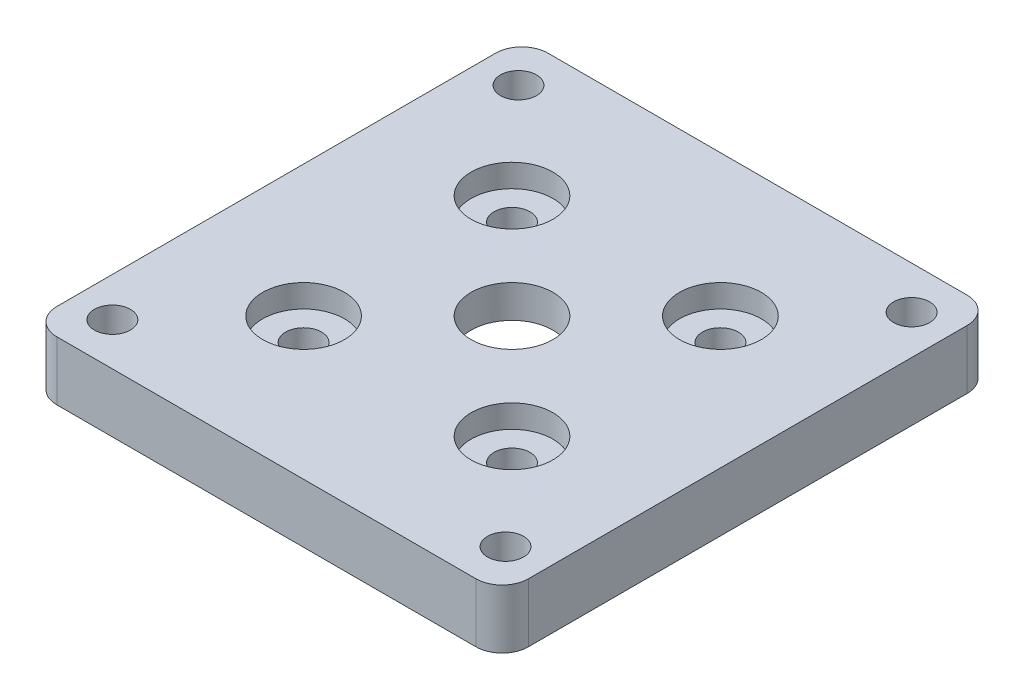
ISO-10303-21;
HEADER;
FILE_DESCRIPTION(('STEP AP214'),'2;1');
FILE_NAME('part.step','',(''),(''),'','','');
FILE_SCHEMA(('AUTOMOTIVE_DESIGN { 1 0 10303 214 1 1 1 1 }'));
ENDSEC;
DATA;
#1=APPLICATION_CONTEXT('core data for automotive mechanical design processes');
#2=APPLICATION_PROTOCOL_DEFINITION('international standard','automotive_design',2000,#1);
#3=PRODUCT_CONTEXT('',#1,'mechanical');
#4=PRODUCT('Part','Part','',(#3));
#5=PRODUCT_RELATED_PRODUCT_CATEGORY('part','',(#4));
#6=PRODUCT_DEFINITION_FORMATION('','',#4);
#7=PRODUCT_DEFINITION_CONTEXT('part definition',#1,'design');
#8=PRODUCT_DEFINITION('design','',#6,#7);
#9=PRODUCT_DEFINITION_SHAPE('','',#8);
#10=(LENGTH_UNIT() NAMED_UNIT(*) SI_UNIT(.MILLI.,.METRE.));
#11=(NAMED_UNIT(*) PLANE_ANGLE_UNIT() SI_UNIT($,.RADIAN.));
#12=(NAMED_UNIT(*) SI_UNIT($,.STERADIAN.) SOLID_ANGLE_UNIT());
#13=UNCERTAINTY_MEASURE_WITH_UNIT(LENGTH_MEASURE(1.E-05),#10,'distance_accuracy_value','');
#14=(GEOMETRIC_REPRESENTATION_CONTEXT(3) GLOBAL_UNCERTAINTY_ASSIGNED_CONTEXT((#13)) GLOBAL_UNIT_ASSIGNED_CONTEXT((#10,
#11,#12)) REPRESENTATION_CONTEXT('',''));
#15=CARTESIAN_POINT('',(0.,0.,0.));
#16=DIRECTION('',(0.,0.,1.));
#17=DIRECTION('',(1.,0.,0.));
#18=AXIS2_PLACEMENT_3D('',#15,#16,#17);
#19=CARTESIAN_POINT('',(45.9199025766973,9.,15.0900974233026));
#20=DIRECTION('',(0.,-1.,0.));
#21=DIRECTION('',(0.,0.,-1.));
#22=AXIS2_PLACEMENT_3D('',#19,#20,#21);
#23=CYLINDRICAL_SURFACE('',#22,2.75);
#24=CARTESIAN_POINT('',(45.9199025766973,0.,15.0900974233026));
#25=DIRECTION('',(0.,1.,0.));
#26=DIRECTION('',(0.,0.,1.));
#27=AXIS2_PLACEMENT_3D('',#24,#25,#26);
#28=CIRCLE('',#27,2.75);
#29=CARTESIAN_POINT('',(45.9199025766973,0.,17.8400974233026));
#30=VERTEX_POINT('',#29);
#31=EDGE_CURVE('E228',#30,#30,#28,.T.);
#32=ORIENTED_EDGE('',*,*,#31,.F.);
#33=EDGE_LOOP('',(#32));
#34=FACE_BOUND('',#33,.T.);
#35=CARTESIAN_POINT('',(45.9199025766973,5.5,15.0900974233026));
#36=DIRECTION('',(0.,1.,0.));
#37=DIRECTION('',(0.,0.,1.));
#38=AXIS2_PLACEMENT_3D('',#35,#36,#37);
#39=CIRCLE('',#38,2.75);
#40=CARTESIAN_POINT('',(45.9199025766973,5.5,17.8400974233026));
#41=VERTEX_POINT('',#40);
#42=EDGE_CURVE('E43',#41,#41,#39,.T.);
#43=ORIENTED_EDGE('',*,*,#42,.T.);
#44=EDGE_LOOP('',(#43));
#45=FACE_BOUND('',#44,.T.);
#46=ADVANCED_FACE('F39',(#34,#45),#23,.F.);
#47=CARTESIAN_POINT('',(45.9199025766975,9.,46.9099025766971));
#48=DIRECTION('',(0.,-1.,0.));
#49=DIRECTION('',(0.,0.,-1.));
#50=AXIS2_PLACEMENT_3D('',#47,#48,#49);
#51=CYLINDRICAL_SURFACE('',#50,2.75);
#52=CARTESIAN_POINT('',(45.9199025766975,0.,46.9099025766971));
#53=DIRECTION('',(0.,1.,0.));
#54=DIRECTION('',(0.,0.,1.));
#55=AXIS2_PLACEMENT_3D('',#52,#53,#54);
#56=CIRCLE('',#55,2.75);
#57=CARTESIAN_POINT('',(45.9199025766975,0.,49.6599025766971));
#58=VERTEX_POINT('',#57);
#59=EDGE_CURVE('E225',#58,#58,#56,.T.);
#60=ORIENTED_EDGE('',*,*,#59,.F.);
#61=EDGE_LOOP('',(#60));
#62=FACE_BOUND('',#61,.T.);
#63=CARTESIAN_POINT('',(45.9199025766975,5.5,46.9099025766971));
#64=DIRECTION('',(0.,1.,0.));
#65=DIRECTION('',(0.,0.,1.));
#66=AXIS2_PLACEMENT_3D('',#63,#64,#65);
#67=CIRCLE('',#66,2.75);
#68=CARTESIAN_POINT('',(45.9199025766975,5.5,49.6599025766971));
#69=VERTEX_POINT('',#68);
#70=EDGE_CURVE('E175',#69,#69,#67,.T.);
#71=ORIENTED_EDGE('',*,*,#70,.T.);
#72=EDGE_LOOP('',(#71));
#73=FACE_BOUND('',#72,.T.);
#74=ADVANCED_FACE('F260',(#62,#73),#51,.F.);
#75=CARTESIAN_POINT('',(14.1000974233028,9.,46.9099025766974));
#76=DIRECTION('',(0.,-1.,0.));
#77=DIRECTION('',(0.,0.,-1.));
#78=AXIS2_PLACEMENT_3D('',#75,#76,#77);
#79=CYLINDRICAL_SURFACE('',#78,2.75);
#80=CARTESIAN_POINT('',(14.1000974233028,0.,46.9099025766974));
#81=DIRECTION('',(0.,1.,0.));
#82=DIRECTION('',(0.,0.,1.));
#83=AXIS2_PLACEMENT_3D('',#80,#81,#82);
#84=CIRCLE('',#83,2.75);
#85=CARTESIAN_POINT('',(14.1000974233028,0.,49.6599025766974));
#86=VERTEX_POINT('',#85);
#87=EDGE_CURVE('E222',#86,#86,#84,.T.);
#88=ORIENTED_EDGE('',*,*,#87,.F.);
#89=EDGE_LOOP('',(#88));
#90=FACE_BOUND('',#89,.T.);
#91=CARTESIAN_POINT('',(14.1000974233028,5.5,46.9099025766974));
#92=DIRECTION('',(0.,1.,0.));
#93=DIRECTION('',(0.,0.,1.));
#94=AXIS2_PLACEMENT_3D('',#91,#92,#93);
#95=CIRCLE('',#94,2.75);
#96=CARTESIAN_POINT('',(14.1000974233028,5.5,49.6599025766974));
#97=VERTEX_POINT('',#96);
#98=EDGE_CURVE('E172',#97,#97,#95,.T.);
#99=ORIENTED_EDGE('',*,*,#98,.T.);
#100=EDGE_LOOP('',(#99));
#101=FACE_BOUND('',#100,.T.);
#102=ADVANCED_FACE('F266',(#90,#101),#79,.F.);
#103=CARTESIAN_POINT('',(14.1000974233026,9.,15.0900974233028));
#104=DIRECTION('',(0.,-1.,0.));
#105=DIRECTION('',(0.,0.,-1.));
#106=AXIS2_PLACEMENT_3D('',#103,#104,#105);
#107=CYLINDRICAL_SURFACE('',#106,2.75);
#108=CARTESIAN_POINT('',(14.1000974233026,0.,15.0900974233028));
#109=DIRECTION('',(0.,1.,0.));
#110=DIRECTION('',(0.,0.,1.));
#111=AXIS2_PLACEMENT_3D('',#108,#109,#110);
#112=CIRCLE('',#111,2.75);
#113=CARTESIAN_POINT('',(14.1000974233026,0.,17.8400974233028));
#114=VERTEX_POINT('',#113);
#115=EDGE_CURVE('E219',#114,#114,#112,.T.);
#116=ORIENTED_EDGE('',*,*,#115,.F.);
#117=EDGE_LOOP('',(#116));
#118=FACE_BOUND('',#117,.T.);
#119=CARTESIAN_POINT('',(14.1000974233026,5.5,15.0900974233028));
#120=DIRECTION('',(0.,1.,0.));
#121=DIRECTION('',(0.,0.,1.));
#122=AXIS2_PLACEMENT_3D('',#119,#120,#121);
#123=CIRCLE('',#122,2.75);
#124=CARTESIAN_POINT('',(14.1000974233026,5.5,17.8400974233028));
#125=VERTEX_POINT('',#124);
#126=EDGE_CURVE('E169',#125,#125,#123,.T.);
#127=ORIENTED_EDGE('',*,*,#126,.T.);
#128=EDGE_LOOP('',(#127));
#129=FACE_BOUND('',#128,.T.);
#130=ADVANCED_FACE('F275',(#118,#129),#107,.F.);
#131=CARTESIAN_POINT('',(30.01,9.,31.));
#132=DIRECTION('',(0.,-1.,0.));
#133=DIRECTION('',(0.,0.,-1.));
#134=AXIS2_PLACEMENT_3D('',#131,#132,#133);
#135=CYLINDRICAL_SURFACE('',#134,6.25);
#136=CARTESIAN_POINT('',(30.01,9.,31.));
#137=DIRECTION('',(0.,1.,0.));
#138=DIRECTION('',(0.,0.,1.));
#139=AXIS2_PLACEMENT_3D('',#136,#137,#138);
#140=CIRCLE('',#139,6.25);
#141=CARTESIAN_POINT('',(30.01,9.,37.25));
#142=VERTEX_POINT('',#141);
#143=EDGE_CURVE('E196',#142,#142,#140,.T.);
#144=ORIENTED_EDGE('',*,*,#143,.T.);
#145=EDGE_LOOP('',(#144));
#146=FACE_BOUND('',#145,.T.);
#147=CARTESIAN_POINT('',(30.01,4.,31.));
#148=DIRECTION('',(0.,-1.,0.));
#149=DIRECTION('',(0.,0.,-1.));
#150=AXIS2_PLACEMENT_3D('',#147,#148,#149);
#151=CIRCLE('',#150,6.25);
#152=CARTESIAN_POINT('',(30.01,4.,24.75));
#153=VERTEX_POINT('',#152);
#154=EDGE_CURVE('E164',#153,#153,#151,.T.);
#155=ORIENTED_EDGE('',*,*,#154,.T.);
#156=EDGE_LOOP('',(#155));
#157=FACE_BOUND('',#156,.T.);
#158=ADVANCED_FACE('F271',(#146,#157),#135,.F.);
#159=CARTESIAN_POINT('',(66.01,9.,0.));
#160=DIRECTION('',(1.,0.,0.));
#161=DIRECTION('',(0.,0.,-1.));
#162=AXIS2_PLACEMENT_3D('',#159,#160,#161);
#163=PLANE('',#162);
#164=DIRECTION('',(0.,0.,1.));
#165=VECTOR('',#164,1.);
#166=CARTESIAN_POINT('',(66.01,9.,0.));
#167=LINE('',#166,#165);
#168=CARTESIAN_POINT('',(66.01,9.,-2.5));
#169=VERTEX_POINT('',#168);
#170=CARTESIAN_POINT('',(66.01,9.,64.5));
#171=VERTEX_POINT('',#170);
#172=EDGE_CURVE('E202',#169,#171,#167,.T.);
#173=ORIENTED_EDGE('',*,*,#172,.T.);
#174=DIRECTION('',(0.,-1.,0.));
#175=VECTOR('',#174,1.);
#176=CARTESIAN_POINT('',(66.01,0.,64.5));
#177=LINE('',#176,#175);
#178=CARTESIAN_POINT('',(66.01,0.,64.5));
#179=VERTEX_POINT('',#178);
#180=EDGE_CURVE('E160',#171,#179,#177,.T.);
#181=ORIENTED_EDGE('',*,*,#180,.T.);
#182=DIRECTION('',(0.,0.,1.));
#183=VECTOR('',#182,1.);
#184=CARTESIAN_POINT('',(66.01,0.,0.));
#185=LINE('',#184,#183);
#186=CARTESIAN_POINT('',(66.01,0.,-2.5));
#187=VERTEX_POINT('',#186);
#188=EDGE_CURVE('E234',#187,#179,#185,.T.);
#189=ORIENTED_EDGE('',*,*,#188,.F.);
#190=DIRECTION('',(0.,-1.,0.));
#191=VECTOR('',#190,1.);
#192=CARTESIAN_POINT('',(66.01,9.,-2.5));
#193=LINE('',#192,#191);
#194=EDGE_CURVE('E158',#187,#169,#193,.F.);
#195=ORIENTED_EDGE('',*,*,#194,.T.);
#196=EDGE_LOOP('',(#173,#181,#189,#195));
#197=FACE_BOUND('',#196,.T.);
#198=ADVANCED_FACE('F256',(#197),#163,.T.);
#199=CARTESIAN_POINT('',(0.,9.,-6.5));
#200=DIRECTION('',(0.,0.,-1.));
#201=DIRECTION('',(-1.,0.,0.));
#202=AXIS2_PLACEMENT_3D('',#199,#200,#201);
#203=PLANE('',#202);
#204=DIRECTION('',(1.,0.,0.));
#205=VECTOR('',#204,1.);
#206=CARTESIAN_POINT('',(0.,9.,-6.5));
#207=LINE('',#206,#205);
#208=CARTESIAN_POINT('',(-1.99,9.,-6.5));
#209=VERTEX_POINT('',#208);
#210=CARTESIAN_POINT('',(62.01,9.,-6.5));
#211=VERTEX_POINT('',#210);
#212=EDGE_CURVE('E205',#209,#211,#207,.T.);
#213=ORIENTED_EDGE('',*,*,#212,.T.);
#214=DIRECTION('',(0.,-1.,0.));
#215=VECTOR('',#214,1.);
#216=CARTESIAN_POINT('',(62.01,9.,-6.5));
#217=LINE('',#216,#215);
#218=CARTESIAN_POINT('',(62.01,0.,-6.5));
#219=VERTEX_POINT('',#218);
#220=EDGE_CURVE('E11',#211,#219,#217,.T.);
#221=ORIENTED_EDGE('',*,*,#220,.T.);
#222=DIRECTION('',(1.,0.,0.));
#223=VECTOR('',#222,1.);
#224=CARTESIAN_POINT('',(0.,0.,-6.5));
#225=LINE('',#224,#223);
#226=CARTESIAN_POINT('',(-1.99,0.,-6.5));
#227=VERTEX_POINT('',#226);
#228=EDGE_CURVE('E139',#227,#219,#225,.T.);
#229=ORIENTED_EDGE('',*,*,#228,.F.);
#230=DIRECTION('',(0.,-1.,0.));
#231=VECTOR('',#230,1.);
#232=CARTESIAN_POINT('',(-1.99,9.,-6.5));
#233=LINE('',#232,#231);
#234=EDGE_CURVE('E48',#227,#209,#233,.F.);
#235=ORIENTED_EDGE('',*,*,#234,.T.);
#236=EDGE_LOOP('',(#213,#221,#229,#235));
#237=FACE_BOUND('',#236,.T.);
#238=ADVANCED_FACE('F237',(#237),#203,.T.);
#239=CARTESIAN_POINT('',(-5.99,9.,0.));
#240=DIRECTION('',(1.,0.,0.));
#241=DIRECTION('',(0.,0.,-1.));
#242=AXIS2_PLACEMENT_3D('',#239,#240,#241);
#243=PLANE('',#242);
#244=DIRECTION('',(0.,0.,1.));
#245=VECTOR('',#244,1.);
#246=CARTESIAN_POINT('',(-5.99,0.,0.));
#247=LINE('',#246,#245);
#248=CARTESIAN_POINT('',(-5.99,0.,-2.5));
#249=VERTEX_POINT('',#248);
#250=CARTESIAN_POINT('',(-5.98999999999999,0.,64.5));
#251=VERTEX_POINT('',#250);
#252=EDGE_CURVE('E134',#249,#251,#247,.T.);
#253=ORIENTED_EDGE('',*,*,#252,.T.);
#254=DIRECTION('',(0.,-1.,0.));
#255=VECTOR('',#254,1.);
#256=CARTESIAN_POINT('',(-5.98999999999999,9.,64.5));
#257=LINE('',#256,#255);
#258=CARTESIAN_POINT('',(-5.98999999999999,9.,64.5));
#259=VERTEX_POINT('',#258);
#260=EDGE_CURVE('E112',#251,#259,#257,.F.);
#261=ORIENTED_EDGE('',*,*,#260,.T.);
#262=DIRECTION('',(0.,0.,1.));
#263=VECTOR('',#262,1.);
#264=CARTESIAN_POINT('',(-5.99,9.,0.));
#265=LINE('',#264,#263);
#266=CARTESIAN_POINT('',(-5.99,9.,-2.5));
#267=VERTEX_POINT('',#266);
#268=EDGE_CURVE('E207',#267,#259,#265,.T.);
#269=ORIENTED_EDGE('',*,*,#268,.F.);
#270=DIRECTION('',(0.,-1.,0.));
#271=VECTOR('',#270,1.);
#272=CARTESIAN_POINT('',(-5.99,0.,-2.5));
#273=LINE('',#272,#271);
#274=EDGE_CURVE('E117',#267,#249,#273,.T.);
#275=ORIENTED_EDGE('',*,*,#274,.T.);
#276=EDGE_LOOP('',(#253,#261,#269,#275));
#277=FACE_BOUND('',#276,.T.);
#278=ADVANCED_FACE('F245',(#277),#243,.F.);
#279=CARTESIAN_POINT('',(0.,9.,0.));
#280=DIRECTION('',(0.,-1.,0.));
#281=DIRECTION('',(0.,0.,-1.));
#282=AXIS2_PLACEMENT_3D('',#279,#280,#281);
#283=CYLINDRICAL_SURFACE('',#282,2.75);
#284=CARTESIAN_POINT('',(0.,9.,0.));
#285=DIRECTION('',(0.,1.,0.));
#286=DIRECTION('',(0.,0.,1.));
#287=AXIS2_PLACEMENT_3D('',#284,#285,#286);
#288=CIRCLE('',#287,2.75);
#289=CARTESIAN_POINT('',(0.,9.,2.75));
#290=VERTEX_POINT('',#289);
#291=EDGE_CURVE('E199',#290,#290,#288,.T.);
#292=ORIENTED_EDGE('',*,*,#291,.T.);
#293=EDGE_LOOP('',(#292));
#294=FACE_BOUND('',#293,.T.);
#295=CARTESIAN_POINT('',(0.,0.,0.));
#296=DIRECTION('',(0.,1.,0.));
#297=DIRECTION('',(0.,0.,1.));
#298=AXIS2_PLACEMENT_3D('',#295,#296,#297);
#299=CIRCLE('',#298,2.75);
#300=CARTESIAN_POINT('',(0.,0.,2.75));
#301=VERTEX_POINT('',#300);
#302=EDGE_CURVE('E231',#301,#301,#299,.T.);
#303=ORIENTED_EDGE('',*,*,#302,.F.);
#304=EDGE_LOOP('',(#303));
#305=FACE_BOUND('',#304,.T.);
#306=ADVANCED_FACE('F247',(#294,#305),#283,.F.);
#307=CARTESIAN_POINT('',(0.,9.,62.));
#308=DIRECTION('',(0.,-1.,0.));
#309=DIRECTION('',(0.,0.,-1.));
#310=AXIS2_PLACEMENT_3D('',#307,#308,#309);
#311=CYLINDRICAL_SURFACE('',#310,2.75);
#312=CARTESIAN_POINT('',(0.,9.,62.));
#313=DIRECTION('',(0.,1.,0.));
#314=DIRECTION('',(0.,0.,1.));
#315=AXIS2_PLACEMENT_3D('',#312,#313,#314);
#316=CIRCLE('',#315,2.75);
#317=CARTESIAN_POINT('',(0.,9.,64.75));
#318=VERTEX_POINT('',#317);
#319=EDGE_CURVE('E193',#318,#318,#316,.T.);
#320=ORIENTED_EDGE('',*,*,#319,.T.);
#321=EDGE_LOOP('',(#320));
#322=FACE_BOUND('',#321,.T.);
#323=CARTESIAN_POINT('',(0.,0.,62.));
#324=DIRECTION('',(0.,1.,0.));
#325=DIRECTION('',(0.,0.,1.));
#326=AXIS2_PLACEMENT_3D('',#323,#324,#325);
#327=CIRCLE('',#326,2.75);
#328=CARTESIAN_POINT('',(0.,0.,64.75));
#329=VERTEX_POINT('',#328);
#330=EDGE_CURVE('E216',#329,#329,#327,.T.);
#331=ORIENTED_EDGE('',*,*,#330,.F.);
#332=EDGE_LOOP('',(#331));
#333=FACE_BOUND('',#332,.T.);
#334=ADVANCED_FACE('F253',(#322,#333),#311,.F.);
#335=CARTESIAN_POINT('',(60.02,9.,0.));
#336=DIRECTION('',(0.,-1.,0.));
#337=DIRECTION('',(0.,0.,-1.));
#338=AXIS2_PLACEMENT_3D('',#335,#336,#337);
#339=CYLINDRICAL_SURFACE('',#338,2.75000000000001);
#340=CARTESIAN_POINT('',(60.02,9.,0.));
#341=DIRECTION('',(0.,1.,0.));
#342=DIRECTION('',(0.,0.,1.));
#343=AXIS2_PLACEMENT_3D('',#340,#341,#342);
#344=CIRCLE('',#343,2.75000000000001);
#345=CARTESIAN_POINT('',(60.02,9.,2.75000000000001));
#346=VERTEX_POINT('',#345);
#347=EDGE_CURVE('E137',#346,#346,#344,.T.);
#348=ORIENTED_EDGE('',*,*,#347,.T.);
#349=EDGE_LOOP('',(#348));
#350=FACE_BOUND('',#349,.T.);
#351=CARTESIAN_POINT('',(60.02,0.,0.));
#352=DIRECTION('',(0.,1.,0.));
#353=DIRECTION('',(0.,0.,1.));
#354=AXIS2_PLACEMENT_3D('',#351,#352,#353);
#355=CIRCLE('',#354,2.75000000000001);
#356=CARTESIAN_POINT('',(60.02,0.,2.75000000000001));
#357=VERTEX_POINT('',#356);
#358=EDGE_CURVE('E213',#357,#357,#355,.T.);
#359=ORIENTED_EDGE('',*,*,#358,.F.);
#360=EDGE_LOOP('',(#359));
#361=FACE_BOUND('',#360,.T.);
#362=ADVANCED_FACE('F282',(#350,#361),#339,.F.);
#363=CARTESIAN_POINT('',(60.02,9.,62.));
#364=DIRECTION('',(0.,-1.,0.));
#365=DIRECTION('',(0.,0.,-1.));
#366=AXIS2_PLACEMENT_3D('',#363,#364,#365);
#367=CYLINDRICAL_SURFACE('',#366,2.75000000000001);
#368=CARTESIAN_POINT('',(60.02,9.,62.));
#369=DIRECTION('',(0.,1.,0.));
#370=DIRECTION('',(0.,0.,1.));
#371=AXIS2_PLACEMENT_3D('',#368,#369,#370);
#372=CIRCLE('',#371,2.75000000000001);
#373=CARTESIAN_POINT('',(60.02,9.,64.75));
#374=VERTEX_POINT('',#373);
#375=EDGE_CURVE('E133',#374,#374,#372,.T.);
#376=ORIENTED_EDGE('',*,*,#375,.T.);
#377=EDGE_LOOP('',(#376));
#378=FACE_BOUND('',#377,.T.);
#379=CARTESIAN_POINT('',(60.02,0.,62.));
#380=DIRECTION('',(0.,1.,0.));
#381=DIRECTION('',(0.,0.,1.));
#382=AXIS2_PLACEMENT_3D('',#379,#380,#381);
#383=CIRCLE('',#382,2.75000000000001);
#384=CARTESIAN_POINT('',(60.02,0.,64.75));
#385=VERTEX_POINT('',#384);
#386=EDGE_CURVE('E167',#385,#385,#383,.T.);
#387=ORIENTED_EDGE('',*,*,#386,.F.);
#388=EDGE_LOOP('',(#387));
#389=FACE_BOUND('',#388,.T.);
#390=ADVANCED_FACE('F286',(#378,#389),#367,.F.);
#391=CARTESIAN_POINT('',(0.,9.,68.5));
#392=DIRECTION('',(0.,0.,-1.));
#393=DIRECTION('',(-1.,0.,0.));
#394=AXIS2_PLACEMENT_3D('',#391,#392,#393);
#395=PLANE('',#394);
#396=DIRECTION('',(1.,0.,0.));
#397=VECTOR('',#396,1.);
#398=CARTESIAN_POINT('',(0.,9.,68.5));
#399=LINE('',#398,#397);
#400=CARTESIAN_POINT('',(-1.98999999999999,9.,68.5));
#401=VERTEX_POINT('',#400);
#402=CARTESIAN_POINT('',(62.01,9.,68.5));
#403=VERTEX_POINT('',#402);
#404=EDGE_CURVE('E127',#401,#403,#399,.T.);
#405=ORIENTED_EDGE('',*,*,#404,.F.);
#406=DIRECTION('',(0.,-1.,0.));
#407=VECTOR('',#406,1.);
#408=CARTESIAN_POINT('',(-1.98999999999999,9.,68.5));
#409=LINE('',#408,#407);
#410=CARTESIAN_POINT('',(-1.98999999999999,0.,68.5));
#411=VERTEX_POINT('',#410);
#412=EDGE_CURVE('E111',#401,#411,#409,.T.);
#413=ORIENTED_EDGE('',*,*,#412,.T.);
#414=DIRECTION('',(1.,0.,0.));
#415=VECTOR('',#414,1.);
#416=CARTESIAN_POINT('',(0.,0.,68.5));
#417=LINE('',#416,#415);
#418=CARTESIAN_POINT('',(62.01,0.,68.5));
#419=VERTEX_POINT('',#418);
#420=EDGE_CURVE('E124',#411,#419,#417,.T.);
#421=ORIENTED_EDGE('',*,*,#420,.T.);
#422=DIRECTION('',(0.,-1.,0.));
#423=VECTOR('',#422,1.);
#424=CARTESIAN_POINT('',(62.01,9.,68.5));
#425=LINE('',#424,#423);
#426=EDGE_CURVE('E129',#419,#403,#425,.F.);
#427=ORIENTED_EDGE('',*,*,#426,.T.);
#428=EDGE_LOOP('',(#405,#413,#421,#427));
#429=FACE_BOUND('',#428,.T.);
#430=ADVANCED_FACE('F123',(#429),#395,.F.);
#431=CARTESIAN_POINT('',(0.,9.,0.));
#432=DIRECTION('',(0.,1.,0.));
#433=DIRECTION('',(0.,0.,1.));
#434=AXIS2_PLACEMENT_3D('',#431,#432,#433);
#435=PLANE('',#434);
#436=CARTESIAN_POINT('',(45.9199025766975,9.,46.9099025766971));
#437=DIRECTION('',(0.,1.,0.));
#438=DIRECTION('',(0.,0.,1.));
#439=AXIS2_PLACEMENT_3D('',#436,#437,#438);
#440=CIRCLE('',#439,6.25);
#441=CARTESIAN_POINT('',(45.9199025766975,9.,53.1599025766971));
#442=VERTEX_POINT('',#441);
#443=EDGE_CURVE('E521',#442,#442,#440,.T.);
#444=ORIENTED_EDGE('',*,*,#443,.F.);
#445=EDGE_LOOP('',(#444));
#446=FACE_BOUND('',#445,.T.);
#447=CARTESIAN_POINT('',(45.9199025766973,9.,15.0900974233026));
#448=DIRECTION('',(0.,1.,0.));
#449=DIRECTION('',(0.,0.,1.));
#450=AXIS2_PLACEMENT_3D('',#447,#448,#449);
#451=CIRCLE('',#450,6.25);
#452=CARTESIAN_POINT('',(45.9199025766973,9.,21.3400974233026));
#453=VERTEX_POINT('',#452);
#454=EDGE_CURVE('E540',#453,#453,#451,.T.);
#455=ORIENTED_EDGE('',*,*,#454,.F.);
#456=EDGE_LOOP('',(#455));
#457=FACE_BOUND('',#456,.T.);
#458=CARTESIAN_POINT('',(14.1000974233026,9.,15.0900974233028));
#459=DIRECTION('',(0.,1.,0.));
#460=DIRECTION('',(0.,0.,1.));
#461=AXIS2_PLACEMENT_3D('',#458,#459,#460);
#462=CIRCLE('',#461,6.25);
#463=CARTESIAN_POINT('',(14.1000974233026,9.,21.3400974233028));
#464=VERTEX_POINT('',#463);
#465=EDGE_CURVE('E531',#464,#464,#462,.T.);
#466=ORIENTED_EDGE('',*,*,#465,.F.);
#467=EDGE_LOOP('',(#466));
#468=FACE_BOUND('',#467,.T.);
#469=CARTESIAN_POINT('',(14.1000974233028,9.,46.9099025766974));
#470=DIRECTION('',(0.,1.,0.));
#471=DIRECTION('',(0.,0.,1.));
#472=AXIS2_PLACEMENT_3D('',#469,#470,#471);
#473=CIRCLE('',#472,6.25);
#474=CARTESIAN_POINT('',(14.1000974233028,9.,53.1599025766974));
#475=VERTEX_POINT('',#474);
#476=EDGE_CURVE('E529',#475,#475,#473,.T.);
#477=ORIENTED_EDGE('',*,*,#476,.F.);
#478=EDGE_LOOP('',(#477));
#479=FACE_BOUND('',#478,.T.);
#480=ORIENTED_EDGE('',*,*,#375,.F.);
#481=EDGE_LOOP('',(#480));
#482=FACE_BOUND('',#481,.T.);
#483=ORIENTED_EDGE('',*,*,#347,.F.);
#484=EDGE_LOOP('',(#483));
#485=FACE_BOUND('',#484,.T.);
#486=ORIENTED_EDGE('',*,*,#319,.F.);
#487=EDGE_LOOP('',(#486));
#488=FACE_BOUND('',#487,.T.);
#489=ORIENTED_EDGE('',*,*,#143,.F.);
#490=EDGE_LOOP('',(#489));
#491=FACE_BOUND('',#490,.T.);
#492=ORIENTED_EDGE('',*,*,#291,.F.);
#493=EDGE_LOOP('',(#492));
#494=FACE_BOUND('',#493,.T.);
#495=ORIENTED_EDGE('',*,*,#268,.T.);
#496=CARTESIAN_POINT('',(-1.98999999999999,9.,64.5));
#497=DIRECTION('',(0.,1.,0.));
#498=DIRECTION('',(0.,0.,1.));
#499=AXIS2_PLACEMENT_3D('',#496,#497,#498);
#500=CIRCLE('',#499,4.);
#501=EDGE_CURVE('E156',#259,#401,#500,.T.);
#502=ORIENTED_EDGE('',*,*,#501,.T.);
#503=ORIENTED_EDGE('',*,*,#404,.T.);
#504=CARTESIAN_POINT('',(62.01,9.,64.5));
#505=DIRECTION('',(0.,1.,0.));
#506=DIRECTION('',(0.,0.,1.));
#507=AXIS2_PLACEMENT_3D('',#504,#505,#506);
#508=CIRCLE('',#507,4.);
#509=EDGE_CURVE('E154',#403,#171,#508,.T.);
#510=ORIENTED_EDGE('',*,*,#509,.T.);
#511=ORIENTED_EDGE('',*,*,#172,.F.);
#512=CARTESIAN_POINT('',(62.01,9.,-2.5));
#513=DIRECTION('',(0.,1.,0.));
#514=DIRECTION('',(0.,0.,1.));
#515=AXIS2_PLACEMENT_3D('',#512,#513,#514);
#516=CIRCLE('',#515,4.);
#517=EDGE_CURVE('E56',#169,#211,#516,.T.);
#518=ORIENTED_EDGE('',*,*,#517,.T.);
#519=ORIENTED_EDGE('',*,*,#212,.F.);
#520=CARTESIAN_POINT('',(-1.99,9.,-2.5));
#521=DIRECTION('',(0.,1.,0.));
#522=DIRECTION('',(0.,0.,1.));
#523=AXIS2_PLACEMENT_3D('',#520,#521,#522);
#524=CIRCLE('',#523,4.);
#525=EDGE_CURVE('E151',#209,#267,#524,.T.);
#526=ORIENTED_EDGE('',*,*,#525,.T.);
#527=EDGE_LOOP('',(#495,#502,#503,#510,#511,#518,#519,#526));
#528=FACE_BOUND('',#527,.T.);
#529=ADVANCED_FACE('F243',(#446,#457,#468,#479,#482,#485,#488,#491,#494,#528),#435,.T.);
#530=CARTESIAN_POINT('',(0.,0.,0.));
#531=DIRECTION('',(0.,1.,0.));
#532=DIRECTION('',(0.,0.,1.));
#533=AXIS2_PLACEMENT_3D('',#530,#531,#532);
#534=PLANE('',#533);
#535=CARTESIAN_POINT('',(30.01,0.,31.));
#536=DIRECTION('',(0.,-1.,0.));
#537=DIRECTION('',(0.,0.,-1.));
#538=AXIS2_PLACEMENT_3D('',#535,#536,#537);
#539=CIRCLE('',#538,16.25);
#540=CARTESIAN_POINT('',(30.01,0.,14.75));
#541=VERTEX_POINT('',#540);
#542=EDGE_CURVE('E180',#541,#541,#539,.T.);
#543=ORIENTED_EDGE('',*,*,#542,.F.);
#544=EDGE_LOOP('',(#543));
#545=FACE_BOUND('',#544,.T.);
#546=ORIENTED_EDGE('',*,*,#386,.T.);
#547=EDGE_LOOP('',(#546));
#548=FACE_BOUND('',#547,.T.);
#549=ORIENTED_EDGE('',*,*,#358,.T.);
#550=EDGE_LOOP('',(#549));
#551=FACE_BOUND('',#550,.T.);
#552=ORIENTED_EDGE('',*,*,#330,.T.);
#553=EDGE_LOOP('',(#552));
#554=FACE_BOUND('',#553,.T.);
#555=ORIENTED_EDGE('',*,*,#115,.T.);
#556=EDGE_LOOP('',(#555));
#557=FACE_BOUND('',#556,.T.);
#558=ORIENTED_EDGE('',*,*,#87,.T.);
#559=EDGE_LOOP('',(#558));
#560=FACE_BOUND('',#559,.T.);
#561=ORIENTED_EDGE('',*,*,#59,.T.);
#562=EDGE_LOOP('',(#561));
#563=FACE_BOUND('',#562,.T.);
#564=ORIENTED_EDGE('',*,*,#31,.T.);
#565=EDGE_LOOP('',(#564));
#566=FACE_BOUND('',#565,.T.);
#567=ORIENTED_EDGE('',*,*,#302,.T.);
#568=EDGE_LOOP('',(#567));
#569=FACE_BOUND('',#568,.T.);
#570=ORIENTED_EDGE('',*,*,#420,.F.);
#571=CARTESIAN_POINT('',(-1.98999999999999,0.,64.5));
#572=DIRECTION('',(0.,1.,0.));
#573=DIRECTION('',(0.,0.,1.));
#574=AXIS2_PLACEMENT_3D('',#571,#572,#573);
#575=CIRCLE('',#574,4.);
#576=EDGE_CURVE('E107',#411,#251,#575,.F.);
#577=ORIENTED_EDGE('',*,*,#576,.T.);
#578=ORIENTED_EDGE('',*,*,#252,.F.);
#579=CARTESIAN_POINT('',(-1.99,0.,-2.5));
#580=DIRECTION('',(0.,1.,0.));
#581=DIRECTION('',(0.,0.,1.));
#582=AXIS2_PLACEMENT_3D('',#579,#580,#581);
#583=CIRCLE('',#582,4.);
#584=EDGE_CURVE('E128',#249,#227,#583,.F.);
#585=ORIENTED_EDGE('',*,*,#584,.T.);
#586=ORIENTED_EDGE('',*,*,#228,.T.);
#587=CARTESIAN_POINT('',(62.01,0.,-2.5));
#588=DIRECTION('',(0.,1.,0.));
#589=DIRECTION('',(0.,0.,1.));
#590=AXIS2_PLACEMENT_3D('',#587,#588,#589);
#591=CIRCLE('',#590,4.);
#592=EDGE_CURVE('E145',#219,#187,#591,.F.);
#593=ORIENTED_EDGE('',*,*,#592,.T.);
#594=ORIENTED_EDGE('',*,*,#188,.T.);
#595=CARTESIAN_POINT('',(62.01,0.,64.5));
#596=DIRECTION('',(0.,1.,0.));
#597=DIRECTION('',(0.,0.,1.));
#598=AXIS2_PLACEMENT_3D('',#595,#596,#597);
#599=CIRCLE('',#598,4.);
#600=EDGE_CURVE('E118',#179,#419,#599,.F.);
#601=ORIENTED_EDGE('',*,*,#600,.T.);
#602=EDGE_LOOP('',(#570,#577,#578,#585,#586,#593,#594,#601));
#603=FACE_BOUND('',#602,.T.);
#604=ADVANCED_FACE('F131',(#545,#548,#551,#554,#557,#560,#563,#566,#569,#603),#534,.F.);
#605=CARTESIAN_POINT('',(-1.98999999999999,9.,64.5));
#606=DIRECTION('',(0.,-1.,0.));
#607=DIRECTION('',(0.,0.,-1.));
#608=AXIS2_PLACEMENT_3D('',#605,#606,#607);
#609=CYLINDRICAL_SURFACE('',#608,4.);
#610=ORIENTED_EDGE('',*,*,#501,.F.);
#611=ORIENTED_EDGE('',*,*,#260,.F.);
#612=ORIENTED_EDGE('',*,*,#576,.F.);
#613=ORIENTED_EDGE('',*,*,#412,.F.);
#614=EDGE_LOOP('',(#610,#611,#612,#613));
#615=FACE_BOUND('',#614,.T.);
#616=ADVANCED_FACE('F110',(#615),#609,.T.);
#617=CARTESIAN_POINT('',(62.01,9.,64.5));
#618=DIRECTION('',(0.,1.,0.));
#619=DIRECTION('',(0.,0.,1.));
#620=AXIS2_PLACEMENT_3D('',#617,#618,#619);
#621=CYLINDRICAL_SURFACE('',#620,4.);
#622=ORIENTED_EDGE('',*,*,#509,.F.);
#623=ORIENTED_EDGE('',*,*,#426,.F.);
#624=ORIENTED_EDGE('',*,*,#600,.F.);
#625=ORIENTED_EDGE('',*,*,#180,.F.);
#626=EDGE_LOOP('',(#622,#623,#624,#625));
#627=FACE_BOUND('',#626,.T.);
#628=ADVANCED_FACE('F293',(#627),#621,.T.);
#629=CARTESIAN_POINT('',(62.01,9.,-2.5));
#630=DIRECTION('',(0.,-1.,0.));
#631=DIRECTION('',(0.,0.,-1.));
#632=AXIS2_PLACEMENT_3D('',#629,#630,#631);
#633=CYLINDRICAL_SURFACE('',#632,4.);
#634=ORIENTED_EDGE('',*,*,#517,.F.);
#635=ORIENTED_EDGE('',*,*,#194,.F.);
#636=ORIENTED_EDGE('',*,*,#592,.F.);
#637=ORIENTED_EDGE('',*,*,#220,.F.);
#638=EDGE_LOOP('',(#634,#635,#636,#637));
#639=FACE_BOUND('',#638,.T.);
#640=ADVANCED_FACE('F295',(#639),#633,.T.);
#641=CARTESIAN_POINT('',(-1.99,9.,-2.5));
#642=DIRECTION('',(0.,1.,0.));
#643=DIRECTION('',(0.,0.,1.));
#644=AXIS2_PLACEMENT_3D('',#641,#642,#643);
#645=CYLINDRICAL_SURFACE('',#644,4.);
#646=ORIENTED_EDGE('',*,*,#525,.F.);
#647=ORIENTED_EDGE('',*,*,#234,.F.);
#648=ORIENTED_EDGE('',*,*,#584,.F.);
#649=ORIENTED_EDGE('',*,*,#274,.F.);
#650=EDGE_LOOP('',(#646,#647,#648,#649));
#651=FACE_BOUND('',#650,.T.);
#652=ADVANCED_FACE('F41',(#651),#645,.T.);
#653=CARTESIAN_POINT('',(30.01,4.,31.));
#654=DIRECTION('',(0.,-1.,0.));
#655=DIRECTION('',(0.,0.,-1.));
#656=AXIS2_PLACEMENT_3D('',#653,#654,#655);
#657=CYLINDRICAL_SURFACE('',#656,16.25);
#658=CARTESIAN_POINT('',(30.01,4.,31.));
#659=DIRECTION('',(0.,-1.,0.));
#660=DIRECTION('',(0.,0.,-1.));
#661=AXIS2_PLACEMENT_3D('',#658,#659,#660);
#662=CIRCLE('',#661,16.25);
#663=CARTESIAN_POINT('',(30.01,4.,14.75));
#664=VERTEX_POINT('',#663);
#665=EDGE_CURVE('E168',#664,#664,#662,.T.);
#666=ORIENTED_EDGE('',*,*,#665,.F.);
#667=EDGE_LOOP('',(#666));
#668=FACE_BOUND('',#667,.T.);
#669=ORIENTED_EDGE('',*,*,#542,.T.);
#670=EDGE_LOOP('',(#669));
#671=FACE_BOUND('',#670,.T.);
#672=ADVANCED_FACE('F302',(#668,#671),#657,.F.);
#673=CARTESIAN_POINT('',(30.01,4.,31.));
#674=DIRECTION('',(0.,-1.,0.));
#675=DIRECTION('',(0.,0.,-1.));
#676=AXIS2_PLACEMENT_3D('',#673,#674,#675);
#677=PLANE('',#676);
#678=ORIENTED_EDGE('',*,*,#154,.F.);
#679=EDGE_LOOP('',(#678));
#680=FACE_BOUND('',#679,.T.);
#681=ORIENTED_EDGE('',*,*,#665,.T.);
#682=EDGE_LOOP('',(#681));
#683=FACE_BOUND('',#682,.T.);
#684=ADVANCED_FACE('F319',(#680,#683),#677,.T.);
#685=CARTESIAN_POINT('',(14.1000974233028,5.5,46.9099025766974));
#686=DIRECTION('',(0.,1.,0.));
#687=DIRECTION('',(0.,0.,1.));
#688=AXIS2_PLACEMENT_3D('',#685,#686,#687);
#689=CYLINDRICAL_SURFACE('',#688,6.25);
#690=CARTESIAN_POINT('',(14.1000974233028,5.5,46.9099025766974));
#691=DIRECTION('',(0.,1.,0.));
#692=DIRECTION('',(0.,0.,1.));
#693=AXIS2_PLACEMENT_3D('',#690,#691,#692);
#694=CIRCLE('',#693,6.25);
#695=CARTESIAN_POINT('',(14.1000974233028,5.5,53.1599025766974));
#696=VERTEX_POINT('',#695);
#697=EDGE_CURVE('E173',#696,#696,#694,.T.);
#698=ORIENTED_EDGE('',*,*,#697,.F.);
#699=EDGE_LOOP('',(#698));
#700=FACE_BOUND('',#699,.T.);
#701=ORIENTED_EDGE('',*,*,#476,.T.);
#702=EDGE_LOOP('',(#701));
#703=FACE_BOUND('',#702,.T.);
#704=ADVANCED_FACE('F322',(#700,#703),#689,.F.);
#705=CARTESIAN_POINT('',(14.1000974233028,5.5,46.9099025766974));
#706=DIRECTION('',(0.,1.,0.));
#707=DIRECTION('',(0.,0.,1.));
#708=AXIS2_PLACEMENT_3D('',#705,#706,#707);
#709=PLANE('',#708);
#710=ORIENTED_EDGE('',*,*,#98,.F.);
#711=EDGE_LOOP('',(#710));
#712=FACE_BOUND('',#711,.T.);
#713=ORIENTED_EDGE('',*,*,#697,.T.);
#714=EDGE_LOOP('',(#713));
#715=FACE_BOUND('',#714,.T.);
#716=ADVANCED_FACE('F426',(#712,#715),#709,.T.);
#717=CARTESIAN_POINT('',(14.1000974233026,5.5,15.0900974233028));
#718=DIRECTION('',(0.,1.,0.));
#719=DIRECTION('',(0.,0.,1.));
#720=AXIS2_PLACEMENT_3D('',#717,#718,#719);
#721=CYLINDRICAL_SURFACE('',#720,6.25);
#722=CARTESIAN_POINT('',(14.1000974233026,5.5,15.0900974233028));
#723=DIRECTION('',(0.,1.,0.));
#724=DIRECTION('',(0.,0.,1.));
#725=AXIS2_PLACEMENT_3D('',#722,#723,#724);
#726=CIRCLE('',#725,6.25);
#727=CARTESIAN_POINT('',(14.1000974233026,5.5,21.3400974233028));
#728=VERTEX_POINT('',#727);
#729=EDGE_CURVE('E535',#728,#728,#726,.T.);
#730=ORIENTED_EDGE('',*,*,#729,.F.);
#731=EDGE_LOOP('',(#730));
#732=FACE_BOUND('',#731,.T.);
#733=ORIENTED_EDGE('',*,*,#465,.T.);
#734=EDGE_LOOP('',(#733));
#735=FACE_BOUND('',#734,.T.);
#736=ADVANCED_FACE('F434',(#732,#735),#721,.F.);
#737=CARTESIAN_POINT('',(14.1000974233026,5.5,15.0900974233028));
#738=DIRECTION('',(0.,1.,0.));
#739=DIRECTION('',(0.,0.,1.));
#740=AXIS2_PLACEMENT_3D('',#737,#738,#739);
#741=PLANE('',#740);
#742=ORIENTED_EDGE('',*,*,#126,.F.);
#743=EDGE_LOOP('',(#742));
#744=FACE_BOUND('',#743,.T.);
#745=ORIENTED_EDGE('',*,*,#729,.T.);
#746=EDGE_LOOP('',(#745));
#747=FACE_BOUND('',#746,.T.);
#748=ADVANCED_FACE('F444',(#744,#747),#741,.T.);
#749=CARTESIAN_POINT('',(45.9199025766973,5.5,15.0900974233026));
#750=DIRECTION('',(0.,1.,0.));
#751=DIRECTION('',(0.,0.,1.));
#752=AXIS2_PLACEMENT_3D('',#749,#750,#751);
#753=CYLINDRICAL_SURFACE('',#752,6.25);
#754=CARTESIAN_POINT('',(45.9199025766973,5.5,15.0900974233026));
#755=DIRECTION('',(0.,1.,0.));
#756=DIRECTION('',(0.,0.,1.));
#757=AXIS2_PLACEMENT_3D('',#754,#755,#756);
#758=CIRCLE('',#757,6.25);
#759=CARTESIAN_POINT('',(45.9199025766973,5.5,21.3400974233026));
#760=VERTEX_POINT('',#759);
#761=EDGE_CURVE('E524',#760,#760,#758,.T.);
#762=ORIENTED_EDGE('',*,*,#761,.F.);
#763=EDGE_LOOP('',(#762));
#764=FACE_BOUND('',#763,.T.);
#765=ORIENTED_EDGE('',*,*,#454,.T.);
#766=EDGE_LOOP('',(#765));
#767=FACE_BOUND('',#766,.T.);
#768=ADVANCED_FACE('F454',(#764,#767),#753,.F.);
#769=CARTESIAN_POINT('',(45.9199025766973,5.5,15.0900974233026));
#770=DIRECTION('',(0.,1.,0.));
#771=DIRECTION('',(0.,0.,1.));
#772=AXIS2_PLACEMENT_3D('',#769,#770,#771);
#773=PLANE('',#772);
#774=ORIENTED_EDGE('',*,*,#42,.F.);
#775=EDGE_LOOP('',(#774));
#776=FACE_BOUND('',#775,.T.);
#777=ORIENTED_EDGE('',*,*,#761,.T.);
#778=EDGE_LOOP('',(#777));
#779=FACE_BOUND('',#778,.T.);
#780=ADVANCED_FACE('F464',(#776,#779),#773,.T.);
#781=CARTESIAN_POINT('',(45.9199025766975,5.5,46.9099025766971));
#782=DIRECTION('',(0.,1.,0.));
#783=DIRECTION('',(0.,0.,1.));
#784=AXIS2_PLACEMENT_3D('',#781,#782,#783);
#785=CYLINDRICAL_SURFACE('',#784,6.25);
#786=CARTESIAN_POINT('',(45.9199025766975,5.5,46.9099025766971));
#787=DIRECTION('',(0.,1.,0.));
#788=DIRECTION('',(0.,0.,1.));
#789=AXIS2_PLACEMENT_3D('',#786,#787,#788);
#790=CIRCLE('',#789,6.25);
#791=CARTESIAN_POINT('',(45.9199025766975,5.5,53.1599025766971));
#792=VERTEX_POINT('',#791);
#793=EDGE_CURVE('E520',#792,#792,#790,.T.);
#794=ORIENTED_EDGE('',*,*,#793,.F.);
#795=EDGE_LOOP('',(#794));
#796=FACE_BOUND('',#795,.T.);
#797=ORIENTED_EDGE('',*,*,#443,.T.);
#798=EDGE_LOOP('',(#797));
#799=FACE_BOUND('',#798,.T.);
#800=ADVANCED_FACE('F474',(#796,#799),#785,.F.);
#801=CARTESIAN_POINT('',(45.9199025766975,5.5,46.9099025766971));
#802=DIRECTION('',(0.,1.,0.));
#803=DIRECTION('',(0.,0.,1.));
#804=AXIS2_PLACEMENT_3D('',#801,#802,#803);
#805=PLANE('',#804);
#806=ORIENTED_EDGE('',*,*,#70,.F.);
#807=EDGE_LOOP('',(#806));
#808=FACE_BOUND('',#807,.T.);
#809=ORIENTED_EDGE('',*,*,#793,.T.);
#810=EDGE_LOOP('',(#809));
#811=FACE_BOUND('',#810,.T.);
#812=ADVANCED_FACE('F484',(#808,#811),#805,.T.);
#813=CLOSED_SHELL('',(#46,#74,#102,#130,#158,#198,#238,#278,#306,#334,#362,#390,#430,#529,#604,
#616,#628,#640,#652,#672,#684,#704,#716,#736,#748,#768,#780,#800,#812));
#814=MANIFOLD_SOLID_BREP('B2',#813);
#815=ADVANCED_BREP_SHAPE_REPRESENTATION('',(#18,#814),#14);
#816=SHAPE_DEFINITION_REPRESENTATION(#9,#815);
ENDSEC;
END-ISO-10303-21;
